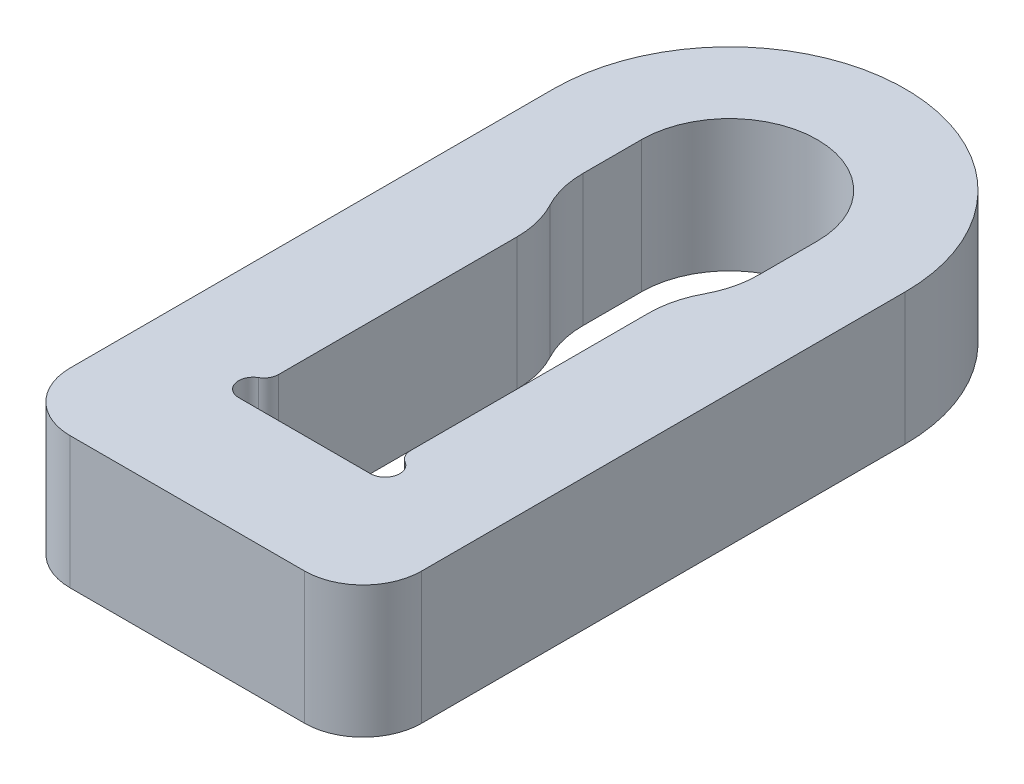
ISO-10303-21;
HEADER;
FILE_DESCRIPTION(('STEP AP214'),'2;1');
FILE_NAME('part.step','',(''),(''),'','','');
FILE_SCHEMA(('AUTOMOTIVE_DESIGN { 1 0 10303 214 1 1 1 1 }'));
ENDSEC;
DATA;
#1=APPLICATION_CONTEXT('core data for automotive mechanical design processes');
#2=APPLICATION_PROTOCOL_DEFINITION('international standard','automotive_design',2000,#1);
#3=PRODUCT_CONTEXT('',#1,'mechanical');
#4=PRODUCT('Part','Part','',(#3));
#5=PRODUCT_RELATED_PRODUCT_CATEGORY('part','',(#4));
#6=PRODUCT_DEFINITION_FORMATION('','',#4);
#7=PRODUCT_DEFINITION_CONTEXT('part definition',#1,'design');
#8=PRODUCT_DEFINITION('design','',#6,#7);
#9=PRODUCT_DEFINITION_SHAPE('','',#8);
#10=(LENGTH_UNIT() NAMED_UNIT(*) SI_UNIT(.MILLI.,.METRE.));
#11=(NAMED_UNIT(*) PLANE_ANGLE_UNIT() SI_UNIT($,.RADIAN.));
#12=(NAMED_UNIT(*) SI_UNIT($,.STERADIAN.) SOLID_ANGLE_UNIT());
#13=UNCERTAINTY_MEASURE_WITH_UNIT(LENGTH_MEASURE(1.E-05),#10,'distance_accuracy_value','');
#14=(GEOMETRIC_REPRESENTATION_CONTEXT(3) GLOBAL_UNCERTAINTY_ASSIGNED_CONTEXT((#13)) GLOBAL_UNIT_ASSIGNED_CONTEXT((#10,
#11,#12)) REPRESENTATION_CONTEXT('',''));
#15=CARTESIAN_POINT('',(0.,0.,0.));
#16=DIRECTION('',(0.,0.,1.));
#17=DIRECTION('',(1.,0.,0.));
#18=AXIS2_PLACEMENT_3D('',#15,#16,#17);
#19=CARTESIAN_POINT('',(0.,4.5,0.));
#20=DIRECTION('',(0.,-1.,0.));
#21=DIRECTION('',(0.,0.,-1.));
#22=AXIS2_PLACEMENT_3D('',#19,#20,#21);
#23=PLANE('',#22);
#24=CARTESIAN_POINT('',(0.,4.5,0.));
#25=DIRECTION('',(0.,1.,0.));
#26=DIRECTION('',(0.,0.,-1.));
#27=AXIS2_PLACEMENT_3D('',#24,#25,#26);
#28=CIRCLE('',#27,6.);
#29=CARTESIAN_POINT('',(6.,4.5,0.));
#30=VERTEX_POINT('',#29);
#31=CARTESIAN_POINT('',(-6.,4.5,0.));
#32=VERTEX_POINT('',#31);
#33=EDGE_CURVE('E277',#30,#32,#28,.T.);
#34=ORIENTED_EDGE('',*,*,#33,.T.);
#35=DIRECTION('',(0.,0.,1.));
#36=VECTOR('',#35,1.);
#37=CARTESIAN_POINT('',(-6.,4.5,0.));
#38=LINE('',#37,#36);
#39=CARTESIAN_POINT('',(-6.,4.5,16.5));
#40=VERTEX_POINT('',#39);
#41=EDGE_CURVE('E280',#32,#40,#38,.T.);
#42=ORIENTED_EDGE('',*,*,#41,.T.);
#43=CARTESIAN_POINT('',(-4.,4.5,16.5));
#44=DIRECTION('',(0.,1.,0.));
#45=DIRECTION('',(0.,0.,-1.));
#46=AXIS2_PLACEMENT_3D('',#43,#44,#45);
#47=CIRCLE('',#46,2.);
#48=CARTESIAN_POINT('',(-4.,4.5,18.5));
#49=VERTEX_POINT('',#48);
#50=EDGE_CURVE('E283',#40,#49,#47,.T.);
#51=ORIENTED_EDGE('',*,*,#50,.T.);
#52=DIRECTION('',(1.,0.,0.));
#53=VECTOR('',#52,1.);
#54=CARTESIAN_POINT('',(-4.,4.5,18.5));
#55=LINE('',#54,#53);
#56=CARTESIAN_POINT('',(4.,4.5,18.5));
#57=VERTEX_POINT('',#56);
#58=EDGE_CURVE('E285',#49,#57,#55,.T.);
#59=ORIENTED_EDGE('',*,*,#58,.T.);
#60=CARTESIAN_POINT('',(4.,4.5,16.5));
#61=DIRECTION('',(0.,1.,0.));
#62=DIRECTION('',(0.,0.,1.));
#63=AXIS2_PLACEMENT_3D('',#60,#61,#62);
#64=CIRCLE('',#63,2.);
#65=CARTESIAN_POINT('',(6.,4.5,16.5));
#66=VERTEX_POINT('',#65);
#67=EDGE_CURVE('E287',#57,#66,#64,.T.);
#68=ORIENTED_EDGE('',*,*,#67,.T.);
#69=DIRECTION('',(0.,0.,-1.));
#70=VECTOR('',#69,1.);
#71=CARTESIAN_POINT('',(6.,4.5,16.5));
#72=LINE('',#71,#70);
#73=EDGE_CURVE('E289',#66,#30,#72,.T.);
#74=ORIENTED_EDGE('',*,*,#73,.T.);
#75=EDGE_LOOP('',(#34,#42,#51,#59,#68,#74));
#76=FACE_BOUND('',#75,.T.);
#77=CARTESIAN_POINT('',(0.,4.5,0.));
#78=DIRECTION('',(0.,1.,0.));
#79=DIRECTION('',(0.,0.,1.));
#80=AXIS2_PLACEMENT_3D('',#77,#78,#79);
#81=CIRCLE('',#80,3.);
#82=CARTESIAN_POINT('',(3.,4.5,0.));
#83=VERTEX_POINT('',#82);
#84=CARTESIAN_POINT('',(-3.,4.5,0.));
#85=VERTEX_POINT('',#84);
#86=EDGE_CURVE('E170',#83,#85,#81,.T.);
#87=ORIENTED_EDGE('',*,*,#86,.F.);
#88=DIRECTION('',(0.,0.,-1.));
#89=VECTOR('',#88,1.);
#90=CARTESIAN_POINT('',(3.,4.5,0.));
#91=LINE('',#90,#89);
#92=CARTESIAN_POINT('',(3.,4.5,2.));
#93=VERTEX_POINT('',#92);
#94=EDGE_CURVE('E215',#93,#83,#91,.T.);
#95=ORIENTED_EDGE('',*,*,#94,.F.);
#96=CARTESIAN_POINT('',(-0.187500000000005,4.5,2.));
#97=DIRECTION('',(0.,1.,0.));
#98=DIRECTION('',(0.,0.,1.));
#99=AXIS2_PLACEMENT_3D('',#96,#97,#98);
#100=CIRCLE('',#99,3.1875);
#101=CARTESIAN_POINT('',(2.625,4.5,3.5));
#102=VERTEX_POINT('',#101);
#103=EDGE_CURVE('E213',#102,#93,#100,.T.);
#104=ORIENTED_EDGE('',*,*,#103,.F.);
#105=CARTESIAN_POINT('',(5.4375,4.5,5.));
#106=DIRECTION('',(0.,-1.,0.));
#107=DIRECTION('',(0.,0.,-1.));
#108=AXIS2_PLACEMENT_3D('',#105,#106,#107);
#109=CIRCLE('',#108,3.1875);
#110=CARTESIAN_POINT('',(2.25,4.5,5.));
#111=VERTEX_POINT('',#110);
#112=EDGE_CURVE('E211',#111,#102,#109,.T.);
#113=ORIENTED_EDGE('',*,*,#112,.F.);
#114=DIRECTION('',(0.,0.,-1.));
#115=VECTOR('',#114,1.);
#116=CARTESIAN_POINT('',(2.25,4.5,5.));
#117=LINE('',#116,#115);
#118=CARTESIAN_POINT('',(2.25,4.5,13.1339745962156));
#119=VERTEX_POINT('',#118);
#120=EDGE_CURVE('E209',#119,#111,#117,.T.);
#121=ORIENTED_EDGE('',*,*,#120,.F.);
#122=CARTESIAN_POINT('',(2.75,4.5,13.1339745962156));
#123=DIRECTION('',(0.,-1.,0.));
#124=DIRECTION('',(0.,0.,-1.));
#125=AXIS2_PLACEMENT_3D('',#122,#123,#124);
#126=CIRCLE('',#125,0.5);
#127=CARTESIAN_POINT('',(2.5,4.5,13.5669872981078));
#128=VERTEX_POINT('',#127);
#129=EDGE_CURVE('E207',#128,#119,#126,.T.);
#130=ORIENTED_EDGE('',*,*,#129,.F.);
#131=CARTESIAN_POINT('',(2.25,4.5,14.));
#132=DIRECTION('',(0.,1.,0.));
#133=DIRECTION('',(0.,0.,1.));
#134=AXIS2_PLACEMENT_3D('',#131,#132,#133);
#135=CIRCLE('',#134,0.5);
#136=CARTESIAN_POINT('',(2.25,4.5,14.5));
#137=VERTEX_POINT('',#136);
#138=EDGE_CURVE('E205',#137,#128,#135,.T.);
#139=ORIENTED_EDGE('',*,*,#138,.F.);
#140=DIRECTION('',(1.,0.,0.));
#141=VECTOR('',#140,1.);
#142=CARTESIAN_POINT('',(-2.25,4.5,14.5));
#143=LINE('',#142,#141);
#144=CARTESIAN_POINT('',(-2.25,4.5,14.5));
#145=VERTEX_POINT('',#144);
#146=EDGE_CURVE('E203',#145,#137,#143,.T.);
#147=ORIENTED_EDGE('',*,*,#146,.F.);
#148=CARTESIAN_POINT('',(-2.25,4.5,14.));
#149=DIRECTION('',(0.,1.,0.));
#150=DIRECTION('',(0.,0.,-1.));
#151=AXIS2_PLACEMENT_3D('',#148,#149,#150);
#152=CIRCLE('',#151,0.5);
#153=CARTESIAN_POINT('',(-2.5,4.5,13.5669872981078));
#154=VERTEX_POINT('',#153);
#155=EDGE_CURVE('E201',#154,#145,#152,.T.);
#156=ORIENTED_EDGE('',*,*,#155,.F.);
#157=CARTESIAN_POINT('',(-2.75,4.5,13.1339745962156));
#158=DIRECTION('',(0.,-1.,0.));
#159=DIRECTION('',(0.,0.,1.));
#160=AXIS2_PLACEMENT_3D('',#157,#158,#159);
#161=CIRCLE('',#160,0.5);
#162=CARTESIAN_POINT('',(-2.25,4.5,13.1339745962156));
#163=VERTEX_POINT('',#162);
#164=EDGE_CURVE('E199',#163,#154,#161,.T.);
#165=ORIENTED_EDGE('',*,*,#164,.F.);
#166=DIRECTION('',(0.,0.,1.));
#167=VECTOR('',#166,1.);
#168=CARTESIAN_POINT('',(-2.25,4.5,5.));
#169=LINE('',#168,#167);
#170=CARTESIAN_POINT('',(-2.25,4.5,5.));
#171=VERTEX_POINT('',#170);
#172=EDGE_CURVE('E197',#171,#163,#169,.T.);
#173=ORIENTED_EDGE('',*,*,#172,.F.);
#174=CARTESIAN_POINT('',(-5.4375,4.5,4.99999999999999));
#175=DIRECTION('',(0.,-1.,0.));
#176=DIRECTION('',(0.,0.,1.));
#177=AXIS2_PLACEMENT_3D('',#174,#175,#176);
#178=CIRCLE('',#177,3.1875);
#179=CARTESIAN_POINT('',(-2.625,4.5,3.49999999999999));
#180=VERTEX_POINT('',#179);
#181=EDGE_CURVE('E193',#180,#171,#178,.T.);
#182=ORIENTED_EDGE('',*,*,#181,.F.);
#183=CARTESIAN_POINT('',(0.187500000000005,4.5,1.99999999999999));
#184=DIRECTION('',(0.,1.,0.));
#185=DIRECTION('',(0.,0.,-1.));
#186=AXIS2_PLACEMENT_3D('',#183,#184,#185);
#187=CIRCLE('',#186,3.1875);
#188=CARTESIAN_POINT('',(-3.,4.5,1.99999999999999));
#189=VERTEX_POINT('',#188);
#190=EDGE_CURVE('E191',#189,#180,#187,.T.);
#191=ORIENTED_EDGE('',*,*,#190,.F.);
#192=DIRECTION('',(0.,0.,1.));
#193=VECTOR('',#192,1.);
#194=CARTESIAN_POINT('',(-3.,4.5,0.));
#195=LINE('',#194,#193);
#196=EDGE_CURVE('E178',#85,#189,#195,.T.);
#197=ORIENTED_EDGE('',*,*,#196,.F.);
#198=EDGE_LOOP('',(#87,#95,#104,#113,#121,#130,#139,#147,#156,#165,#173,#182,#191,#197));
#199=FACE_BOUND('',#198,.T.);
#200=ADVANCED_FACE('F33',(#76,#199),#23,.F.);
#201=CARTESIAN_POINT('',(0.,0.,0.));
#202=DIRECTION('',(0.,-1.,0.));
#203=DIRECTION('',(0.,0.,-1.));
#204=AXIS2_PLACEMENT_3D('',#201,#202,#203);
#205=PLANE('',#204);
#206=CARTESIAN_POINT('',(0.,0.,0.));
#207=DIRECTION('',(0.,1.,0.));
#208=DIRECTION('',(0.,0.,-1.));
#209=AXIS2_PLACEMENT_3D('',#206,#207,#208);
#210=CIRCLE('',#209,6.);
#211=CARTESIAN_POINT('',(6.,0.,0.));
#212=VERTEX_POINT('',#211);
#213=CARTESIAN_POINT('',(-6.,0.,0.));
#214=VERTEX_POINT('',#213);
#215=EDGE_CURVE('E186',#212,#214,#210,.T.);
#216=ORIENTED_EDGE('',*,*,#215,.F.);
#217=DIRECTION('',(0.,0.,-1.));
#218=VECTOR('',#217,1.);
#219=CARTESIAN_POINT('',(6.00000000000001,0.,5.));
#220=LINE('',#219,#218);
#221=CARTESIAN_POINT('',(6.,0.,16.5));
#222=VERTEX_POINT('',#221);
#223=EDGE_CURVE('E281',#222,#212,#220,.T.);
#224=ORIENTED_EDGE('',*,*,#223,.F.);
#225=CARTESIAN_POINT('',(4.,0.,16.5));
#226=DIRECTION('',(0.,1.,0.));
#227=DIRECTION('',(0.,0.,1.));
#228=AXIS2_PLACEMENT_3D('',#225,#226,#227);
#229=CIRCLE('',#228,2.);
#230=CARTESIAN_POINT('',(4.,0.,18.5));
#231=VERTEX_POINT('',#230);
#232=EDGE_CURVE('E300',#231,#222,#229,.T.);
#233=ORIENTED_EDGE('',*,*,#232,.F.);
#234=DIRECTION('',(1.,0.,0.));
#235=VECTOR('',#234,1.);
#236=CARTESIAN_POINT('',(-4.,0.,18.5));
#237=LINE('',#236,#235);
#238=CARTESIAN_POINT('',(-4.,0.,18.5));
#239=VERTEX_POINT('',#238);
#240=EDGE_CURVE('E298',#239,#231,#237,.T.);
#241=ORIENTED_EDGE('',*,*,#240,.F.);
#242=CARTESIAN_POINT('',(-4.,0.,16.5));
#243=DIRECTION('',(0.,1.,0.));
#244=DIRECTION('',(0.,0.,-1.));
#245=AXIS2_PLACEMENT_3D('',#242,#243,#244);
#246=CIRCLE('',#245,2.);
#247=CARTESIAN_POINT('',(-6.,0.,16.5));
#248=VERTEX_POINT('',#247);
#249=EDGE_CURVE('E296',#248,#239,#246,.T.);
#250=ORIENTED_EDGE('',*,*,#249,.F.);
#251=DIRECTION('',(0.,0.,1.));
#252=VECTOR('',#251,1.);
#253=CARTESIAN_POINT('',(-6.,0.,5.));
#254=LINE('',#253,#252);
#255=EDGE_CURVE('E294',#214,#248,#254,.T.);
#256=ORIENTED_EDGE('',*,*,#255,.F.);
#257=EDGE_LOOP('',(#216,#224,#233,#241,#250,#256));
#258=FACE_BOUND('',#257,.T.);
#259=DIRECTION('',(0.,0.,-1.));
#260=VECTOR('',#259,1.);
#261=CARTESIAN_POINT('',(3.,0.,0.));
#262=LINE('',#261,#260);
#263=CARTESIAN_POINT('',(3.,0.,2.));
#264=VERTEX_POINT('',#263);
#265=CARTESIAN_POINT('',(3.,0.,0.));
#266=VERTEX_POINT('',#265);
#267=EDGE_CURVE('E179',#264,#266,#262,.T.);
#268=ORIENTED_EDGE('',*,*,#267,.T.);
#269=CARTESIAN_POINT('',(0.,0.,0.));
#270=DIRECTION('',(0.,1.,0.));
#271=DIRECTION('',(0.,0.,1.));
#272=AXIS2_PLACEMENT_3D('',#269,#270,#271);
#273=CIRCLE('',#272,3.);
#274=CARTESIAN_POINT('',(-3.,0.,0.));
#275=VERTEX_POINT('',#274);
#276=EDGE_CURVE('E56',#266,#275,#273,.T.);
#277=ORIENTED_EDGE('',*,*,#276,.T.);
#278=DIRECTION('',(0.,0.,1.));
#279=VECTOR('',#278,1.);
#280=CARTESIAN_POINT('',(-3.,0.,0.));
#281=LINE('',#280,#279);
#282=CARTESIAN_POINT('',(-3.,0.,1.99999999999999));
#283=VERTEX_POINT('',#282);
#284=EDGE_CURVE('E185',#275,#283,#281,.T.);
#285=ORIENTED_EDGE('',*,*,#284,.T.);
#286=CARTESIAN_POINT('',(0.187500000000005,0.,1.99999999999999));
#287=DIRECTION('',(0.,1.,0.));
#288=DIRECTION('',(0.,0.,-1.));
#289=AXIS2_PLACEMENT_3D('',#286,#287,#288);
#290=CIRCLE('',#289,3.1875);
#291=CARTESIAN_POINT('',(-2.625,0.,3.49999999999999));
#292=VERTEX_POINT('',#291);
#293=EDGE_CURVE('E219',#283,#292,#290,.T.);
#294=ORIENTED_EDGE('',*,*,#293,.T.);
#295=CARTESIAN_POINT('',(-5.4375,0.,4.99999999999999));
#296=DIRECTION('',(0.,-1.,0.));
#297=DIRECTION('',(0.,0.,1.));
#298=AXIS2_PLACEMENT_3D('',#295,#296,#297);
#299=CIRCLE('',#298,3.1875);
#300=CARTESIAN_POINT('',(-2.25,0.,5.));
#301=VERTEX_POINT('',#300);
#302=EDGE_CURVE('E222',#292,#301,#299,.T.);
#303=ORIENTED_EDGE('',*,*,#302,.T.);
#304=DIRECTION('',(0.,0.,1.));
#305=VECTOR('',#304,1.);
#306=CARTESIAN_POINT('',(-2.25,0.,5.));
#307=LINE('',#306,#305);
#308=CARTESIAN_POINT('',(-2.25,0.,13.1339745962156));
#309=VERTEX_POINT('',#308);
#310=EDGE_CURVE('E225',#301,#309,#307,.T.);
#311=ORIENTED_EDGE('',*,*,#310,.T.);
#312=CARTESIAN_POINT('',(-2.75,0.,13.1339745962156));
#313=DIRECTION('',(0.,-1.,0.));
#314=DIRECTION('',(0.,0.,1.));
#315=AXIS2_PLACEMENT_3D('',#312,#313,#314);
#316=CIRCLE('',#315,0.5);
#317=CARTESIAN_POINT('',(-2.5,0.,13.5669872981078));
#318=VERTEX_POINT('',#317);
#319=EDGE_CURVE('E228',#309,#318,#316,.T.);
#320=ORIENTED_EDGE('',*,*,#319,.T.);
#321=CARTESIAN_POINT('',(-2.25,0.,14.));
#322=DIRECTION('',(0.,1.,0.));
#323=DIRECTION('',(0.,0.,-1.));
#324=AXIS2_PLACEMENT_3D('',#321,#322,#323);
#325=CIRCLE('',#324,0.5);
#326=CARTESIAN_POINT('',(-2.25,0.,14.5));
#327=VERTEX_POINT('',#326);
#328=EDGE_CURVE('E231',#318,#327,#325,.T.);
#329=ORIENTED_EDGE('',*,*,#328,.T.);
#330=DIRECTION('',(1.,0.,0.));
#331=VECTOR('',#330,1.);
#332=CARTESIAN_POINT('',(-2.25,0.,14.5));
#333=LINE('',#332,#331);
#334=CARTESIAN_POINT('',(2.25,0.,14.5));
#335=VERTEX_POINT('',#334);
#336=EDGE_CURVE('E234',#327,#335,#333,.T.);
#337=ORIENTED_EDGE('',*,*,#336,.T.);
#338=CARTESIAN_POINT('',(2.25,0.,14.));
#339=DIRECTION('',(0.,1.,0.));
#340=DIRECTION('',(0.,0.,1.));
#341=AXIS2_PLACEMENT_3D('',#338,#339,#340);
#342=CIRCLE('',#341,0.5);
#343=CARTESIAN_POINT('',(2.5,0.,13.5669872981078));
#344=VERTEX_POINT('',#343);
#345=EDGE_CURVE('E237',#335,#344,#342,.T.);
#346=ORIENTED_EDGE('',*,*,#345,.T.);
#347=CARTESIAN_POINT('',(2.75,0.,13.1339745962156));
#348=DIRECTION('',(0.,-1.,0.));
#349=DIRECTION('',(0.,0.,-1.));
#350=AXIS2_PLACEMENT_3D('',#347,#348,#349);
#351=CIRCLE('',#350,0.5);
#352=CARTESIAN_POINT('',(2.25,0.,13.1339745962156));
#353=VERTEX_POINT('',#352);
#354=EDGE_CURVE('E240',#344,#353,#351,.T.);
#355=ORIENTED_EDGE('',*,*,#354,.T.);
#356=DIRECTION('',(0.,0.,-1.));
#357=VECTOR('',#356,1.);
#358=CARTESIAN_POINT('',(2.25,0.,5.));
#359=LINE('',#358,#357);
#360=CARTESIAN_POINT('',(2.25,0.,5.));
#361=VERTEX_POINT('',#360);
#362=EDGE_CURVE('E243',#353,#361,#359,.T.);
#363=ORIENTED_EDGE('',*,*,#362,.T.);
#364=CARTESIAN_POINT('',(5.4375,0.,5.));
#365=DIRECTION('',(0.,-1.,0.));
#366=DIRECTION('',(0.,0.,-1.));
#367=AXIS2_PLACEMENT_3D('',#364,#365,#366);
#368=CIRCLE('',#367,3.1875);
#369=CARTESIAN_POINT('',(2.625,0.,3.5));
#370=VERTEX_POINT('',#369);
#371=EDGE_CURVE('E246',#361,#370,#368,.T.);
#372=ORIENTED_EDGE('',*,*,#371,.T.);
#373=CARTESIAN_POINT('',(-0.187500000000005,0.,2.));
#374=DIRECTION('',(0.,1.,0.));
#375=DIRECTION('',(0.,0.,1.));
#376=AXIS2_PLACEMENT_3D('',#373,#374,#375);
#377=CIRCLE('',#376,3.1875);
#378=EDGE_CURVE('E249',#370,#264,#377,.T.);
#379=ORIENTED_EDGE('',*,*,#378,.T.);
#380=EDGE_LOOP('',(#268,#277,#285,#294,#303,#311,#320,#329,#337,#346,#355,#363,#372,#379));
#381=FACE_BOUND('',#380,.T.);
#382=ADVANCED_FACE('F325',(#258,#381),#205,.T.);
#383=CARTESIAN_POINT('',(0.,4.5,0.));
#384=DIRECTION('',(0.,-1.,0.));
#385=DIRECTION('',(0.,0.,-1.));
#386=AXIS2_PLACEMENT_3D('',#383,#384,#385);
#387=CYLINDRICAL_SURFACE('',#386,6.);
#388=ORIENTED_EDGE('',*,*,#215,.T.);
#389=DIRECTION('',(0.,-1.,0.));
#390=VECTOR('',#389,1.);
#391=CARTESIAN_POINT('',(-6.,4.5,0.));
#392=LINE('',#391,#390);
#393=EDGE_CURVE('E11',#32,#214,#392,.T.);
#394=ORIENTED_EDGE('',*,*,#393,.F.);
#395=ORIENTED_EDGE('',*,*,#33,.F.);
#396=DIRECTION('',(0.,-1.,0.));
#397=VECTOR('',#396,1.);
#398=CARTESIAN_POINT('',(6.,4.5,0.));
#399=LINE('',#398,#397);
#400=EDGE_CURVE('E291',#30,#212,#399,.T.);
#401=ORIENTED_EDGE('',*,*,#400,.T.);
#402=EDGE_LOOP('',(#388,#394,#395,#401));
#403=FACE_BOUND('',#402,.T.);
#404=ADVANCED_FACE('F35',(#403),#387,.T.);
#405=CARTESIAN_POINT('',(-6.,4.5,5.));
#406=DIRECTION('',(1.,0.,0.));
#407=DIRECTION('',(0.,0.,-1.));
#408=AXIS2_PLACEMENT_3D('',#405,#406,#407);
#409=PLANE('',#408);
#410=ORIENTED_EDGE('',*,*,#255,.T.);
#411=DIRECTION('',(0.,-1.,0.));
#412=VECTOR('',#411,1.);
#413=CARTESIAN_POINT('',(-6.,4.5,16.5));
#414=LINE('',#413,#412);
#415=EDGE_CURVE('E41',#40,#248,#414,.T.);
#416=ORIENTED_EDGE('',*,*,#415,.F.);
#417=ORIENTED_EDGE('',*,*,#41,.F.);
#418=ORIENTED_EDGE('',*,*,#393,.T.);
#419=EDGE_LOOP('',(#410,#416,#417,#418));
#420=FACE_BOUND('',#419,.T.);
#421=ADVANCED_FACE('F341',(#420),#409,.F.);
#422=CARTESIAN_POINT('',(-4.,4.5,16.5));
#423=DIRECTION('',(0.,-1.,0.));
#424=DIRECTION('',(0.,0.,-1.));
#425=AXIS2_PLACEMENT_3D('',#422,#423,#424);
#426=CYLINDRICAL_SURFACE('',#425,2.);
#427=ORIENTED_EDGE('',*,*,#249,.T.);
#428=DIRECTION('',(0.,-1.,0.));
#429=VECTOR('',#428,1.);
#430=CARTESIAN_POINT('',(-4.,4.5,18.5));
#431=LINE('',#430,#429);
#432=EDGE_CURVE('E312',#49,#239,#431,.T.);
#433=ORIENTED_EDGE('',*,*,#432,.F.);
#434=ORIENTED_EDGE('',*,*,#50,.F.);
#435=ORIENTED_EDGE('',*,*,#415,.T.);
#436=EDGE_LOOP('',(#427,#433,#434,#435));
#437=FACE_BOUND('',#436,.T.);
#438=ADVANCED_FACE('F319',(#437),#426,.T.);
#439=CARTESIAN_POINT('',(-4.,4.5,18.5));
#440=DIRECTION('',(0.,0.,-1.));
#441=DIRECTION('',(-1.,0.,0.));
#442=AXIS2_PLACEMENT_3D('',#439,#440,#441);
#443=PLANE('',#442);
#444=ORIENTED_EDGE('',*,*,#240,.T.);
#445=DIRECTION('',(0.,-1.,0.));
#446=VECTOR('',#445,1.);
#447=CARTESIAN_POINT('',(4.,4.5,18.5));
#448=LINE('',#447,#446);
#449=EDGE_CURVE('E309',#57,#231,#448,.T.);
#450=ORIENTED_EDGE('',*,*,#449,.F.);
#451=ORIENTED_EDGE('',*,*,#58,.F.);
#452=ORIENTED_EDGE('',*,*,#432,.T.);
#453=EDGE_LOOP('',(#444,#450,#451,#452));
#454=FACE_BOUND('',#453,.T.);
#455=ADVANCED_FACE('F330',(#454),#443,.F.);
#456=CARTESIAN_POINT('',(4.,4.5,16.5));
#457=DIRECTION('',(0.,-1.,0.));
#458=DIRECTION('',(0.,0.,-1.));
#459=AXIS2_PLACEMENT_3D('',#456,#457,#458);
#460=CYLINDRICAL_SURFACE('',#459,2.);
#461=ORIENTED_EDGE('',*,*,#232,.T.);
#462=DIRECTION('',(0.,-1.,0.));
#463=VECTOR('',#462,1.);
#464=CARTESIAN_POINT('',(6.,4.5,16.5));
#465=LINE('',#464,#463);
#466=EDGE_CURVE('E306',#66,#222,#465,.T.);
#467=ORIENTED_EDGE('',*,*,#466,.F.);
#468=ORIENTED_EDGE('',*,*,#67,.F.);
#469=ORIENTED_EDGE('',*,*,#449,.T.);
#470=EDGE_LOOP('',(#461,#467,#468,#469));
#471=FACE_BOUND('',#470,.T.);
#472=ADVANCED_FACE('F334',(#471),#460,.T.);
#473=CARTESIAN_POINT('',(6.00000000000001,4.5,5.));
#474=DIRECTION('',(-1.,0.,0.));
#475=DIRECTION('',(0.,0.,1.));
#476=AXIS2_PLACEMENT_3D('',#473,#474,#475);
#477=PLANE('',#476);
#478=ORIENTED_EDGE('',*,*,#223,.T.);
#479=ORIENTED_EDGE('',*,*,#400,.F.);
#480=ORIENTED_EDGE('',*,*,#73,.F.);
#481=ORIENTED_EDGE('',*,*,#466,.T.);
#482=EDGE_LOOP('',(#478,#479,#480,#481));
#483=FACE_BOUND('',#482,.T.);
#484=ADVANCED_FACE('F344',(#483),#477,.F.);
#485=CARTESIAN_POINT('',(0.,4.5,0.));
#486=DIRECTION('',(0.,-1.,0.));
#487=DIRECTION('',(0.,0.,-1.));
#488=AXIS2_PLACEMENT_3D('',#485,#486,#487);
#489=CYLINDRICAL_SURFACE('',#488,3.);
#490=ORIENTED_EDGE('',*,*,#276,.F.);
#491=DIRECTION('',(0.,-1.,0.));
#492=VECTOR('',#491,1.);
#493=CARTESIAN_POINT('',(3.,4.5,0.));
#494=LINE('',#493,#492);
#495=EDGE_CURVE('E174',#83,#266,#494,.T.);
#496=ORIENTED_EDGE('',*,*,#495,.F.);
#497=ORIENTED_EDGE('',*,*,#86,.T.);
#498=DIRECTION('',(0.,-1.,0.));
#499=VECTOR('',#498,1.);
#500=CARTESIAN_POINT('',(-3.,4.5,0.));
#501=LINE('',#500,#499);
#502=EDGE_CURVE('E173',#85,#275,#501,.T.);
#503=ORIENTED_EDGE('',*,*,#502,.T.);
#504=EDGE_LOOP('',(#490,#496,#497,#503));
#505=FACE_BOUND('',#504,.T.);
#506=ADVANCED_FACE('F172',(#505),#489,.F.);
#507=CARTESIAN_POINT('',(-3.,4.5,0.));
#508=DIRECTION('',(1.,0.,0.));
#509=DIRECTION('',(0.,0.,-1.));
#510=AXIS2_PLACEMENT_3D('',#507,#508,#509);
#511=PLANE('',#510);
#512=ORIENTED_EDGE('',*,*,#284,.F.);
#513=ORIENTED_EDGE('',*,*,#502,.F.);
#514=ORIENTED_EDGE('',*,*,#196,.T.);
#515=DIRECTION('',(0.,-1.,0.));
#516=VECTOR('',#515,1.);
#517=CARTESIAN_POINT('',(-3.,4.5,1.99999999999999));
#518=LINE('',#517,#516);
#519=EDGE_CURVE('E187',#189,#283,#518,.T.);
#520=ORIENTED_EDGE('',*,*,#519,.T.);
#521=EDGE_LOOP('',(#512,#513,#514,#520));
#522=FACE_BOUND('',#521,.T.);
#523=ADVANCED_FACE('F182',(#522),#511,.T.);
#524=CARTESIAN_POINT('',(0.187500000000005,4.5,1.99999999999999));
#525=DIRECTION('',(0.,-1.,0.));
#526=DIRECTION('',(0.,0.,-1.));
#527=AXIS2_PLACEMENT_3D('',#524,#525,#526);
#528=CYLINDRICAL_SURFACE('',#527,3.1875);
#529=ORIENTED_EDGE('',*,*,#293,.F.);
#530=ORIENTED_EDGE('',*,*,#519,.F.);
#531=ORIENTED_EDGE('',*,*,#190,.T.);
#532=DIRECTION('',(0.,-1.,0.));
#533=VECTOR('',#532,1.);
#534=CARTESIAN_POINT('',(-2.625,4.5,3.49999999999999));
#535=LINE('',#534,#533);
#536=EDGE_CURVE('E274',#180,#292,#535,.T.);
#537=ORIENTED_EDGE('',*,*,#536,.T.);
#538=EDGE_LOOP('',(#529,#530,#531,#537));
#539=FACE_BOUND('',#538,.T.);
#540=ADVANCED_FACE('F362',(#539),#528,.F.);
#541=CARTESIAN_POINT('',(-5.4375,4.5,4.99999999999999));
#542=DIRECTION('',(0.,-1.,0.));
#543=DIRECTION('',(0.,0.,-1.));
#544=AXIS2_PLACEMENT_3D('',#541,#542,#543);
#545=CYLINDRICAL_SURFACE('',#544,3.1875);
#546=ORIENTED_EDGE('',*,*,#302,.F.);
#547=ORIENTED_EDGE('',*,*,#536,.F.);
#548=ORIENTED_EDGE('',*,*,#181,.T.);
#549=DIRECTION('',(0.,-1.,0.));
#550=VECTOR('',#549,1.);
#551=CARTESIAN_POINT('',(-2.25,4.5,5.));
#552=LINE('',#551,#550);
#553=EDGE_CURVE('E272',#171,#301,#552,.T.);
#554=ORIENTED_EDGE('',*,*,#553,.T.);
#555=EDGE_LOOP('',(#546,#547,#548,#554));
#556=FACE_BOUND('',#555,.T.);
#557=ADVANCED_FACE('F365',(#556),#545,.T.);
#558=CARTESIAN_POINT('',(-2.25,4.5,5.));
#559=DIRECTION('',(1.,0.,0.));
#560=DIRECTION('',(0.,0.,-1.));
#561=AXIS2_PLACEMENT_3D('',#558,#559,#560);
#562=PLANE('',#561);
#563=ORIENTED_EDGE('',*,*,#310,.F.);
#564=ORIENTED_EDGE('',*,*,#553,.F.);
#565=ORIENTED_EDGE('',*,*,#172,.T.);
#566=DIRECTION('',(0.,-1.,0.));
#567=VECTOR('',#566,1.);
#568=CARTESIAN_POINT('',(-2.25,4.5,13.1339745962156));
#569=LINE('',#568,#567);
#570=EDGE_CURVE('E270',#163,#309,#569,.T.);
#571=ORIENTED_EDGE('',*,*,#570,.T.);
#572=EDGE_LOOP('',(#563,#564,#565,#571));
#573=FACE_BOUND('',#572,.T.);
#574=ADVANCED_FACE('F369',(#573),#562,.T.);
#575=CARTESIAN_POINT('',(-2.75,4.5,13.1339745962156));
#576=DIRECTION('',(0.,-1.,0.));
#577=DIRECTION('',(0.,0.,-1.));
#578=AXIS2_PLACEMENT_3D('',#575,#576,#577);
#579=CYLINDRICAL_SURFACE('',#578,0.5);
#580=ORIENTED_EDGE('',*,*,#319,.F.);
#581=ORIENTED_EDGE('',*,*,#570,.F.);
#582=ORIENTED_EDGE('',*,*,#164,.T.);
#583=DIRECTION('',(0.,-1.,0.));
#584=VECTOR('',#583,1.);
#585=CARTESIAN_POINT('',(-2.5,4.5,13.5669872981078));
#586=LINE('',#585,#584);
#587=EDGE_CURVE('E268',#154,#318,#586,.T.);
#588=ORIENTED_EDGE('',*,*,#587,.T.);
#589=EDGE_LOOP('',(#580,#581,#582,#588));
#590=FACE_BOUND('',#589,.T.);
#591=ADVANCED_FACE('F373',(#590),#579,.T.);
#592=CARTESIAN_POINT('',(-2.25,4.5,14.));
#593=DIRECTION('',(0.,-1.,0.));
#594=DIRECTION('',(0.,0.,-1.));
#595=AXIS2_PLACEMENT_3D('',#592,#593,#594);
#596=CYLINDRICAL_SURFACE('',#595,0.5);
#597=ORIENTED_EDGE('',*,*,#328,.F.);
#598=ORIENTED_EDGE('',*,*,#587,.F.);
#599=ORIENTED_EDGE('',*,*,#155,.T.);
#600=DIRECTION('',(0.,-1.,0.));
#601=VECTOR('',#600,1.);
#602=CARTESIAN_POINT('',(-2.25,4.5,14.5));
#603=LINE('',#602,#601);
#604=EDGE_CURVE('E266',#145,#327,#603,.T.);
#605=ORIENTED_EDGE('',*,*,#604,.T.);
#606=EDGE_LOOP('',(#597,#598,#599,#605));
#607=FACE_BOUND('',#606,.T.);
#608=ADVANCED_FACE('F377',(#607),#596,.F.);
#609=CARTESIAN_POINT('',(-2.25,4.5,14.5));
#610=DIRECTION('',(0.,0.,-1.));
#611=DIRECTION('',(-1.,0.,0.));
#612=AXIS2_PLACEMENT_3D('',#609,#610,#611);
#613=PLANE('',#612);
#614=ORIENTED_EDGE('',*,*,#336,.F.);
#615=ORIENTED_EDGE('',*,*,#604,.F.);
#616=ORIENTED_EDGE('',*,*,#146,.T.);
#617=DIRECTION('',(0.,-1.,0.));
#618=VECTOR('',#617,1.);
#619=CARTESIAN_POINT('',(2.25,4.5,14.5));
#620=LINE('',#619,#618);
#621=EDGE_CURVE('E264',#137,#335,#620,.T.);
#622=ORIENTED_EDGE('',*,*,#621,.T.);
#623=EDGE_LOOP('',(#614,#615,#616,#622));
#624=FACE_BOUND('',#623,.T.);
#625=ADVANCED_FACE('F381',(#624),#613,.T.);
#626=CARTESIAN_POINT('',(2.25,4.5,14.));
#627=DIRECTION('',(0.,-1.,0.));
#628=DIRECTION('',(0.,0.,-1.));
#629=AXIS2_PLACEMENT_3D('',#626,#627,#628);
#630=CYLINDRICAL_SURFACE('',#629,0.5);
#631=ORIENTED_EDGE('',*,*,#345,.F.);
#632=ORIENTED_EDGE('',*,*,#621,.F.);
#633=ORIENTED_EDGE('',*,*,#138,.T.);
#634=DIRECTION('',(0.,-1.,0.));
#635=VECTOR('',#634,1.);
#636=CARTESIAN_POINT('',(2.5,4.5,13.5669872981078));
#637=LINE('',#636,#635);
#638=EDGE_CURVE('E262',#128,#344,#637,.T.);
#639=ORIENTED_EDGE('',*,*,#638,.T.);
#640=EDGE_LOOP('',(#631,#632,#633,#639));
#641=FACE_BOUND('',#640,.T.);
#642=ADVANCED_FACE('F385',(#641),#630,.F.);
#643=CARTESIAN_POINT('',(2.75,4.5,13.1339745962156));
#644=DIRECTION('',(0.,-1.,0.));
#645=DIRECTION('',(0.,0.,-1.));
#646=AXIS2_PLACEMENT_3D('',#643,#644,#645);
#647=CYLINDRICAL_SURFACE('',#646,0.5);
#648=ORIENTED_EDGE('',*,*,#354,.F.);
#649=ORIENTED_EDGE('',*,*,#638,.F.);
#650=ORIENTED_EDGE('',*,*,#129,.T.);
#651=DIRECTION('',(0.,-1.,0.));
#652=VECTOR('',#651,1.);
#653=CARTESIAN_POINT('',(2.25,4.5,13.1339745962156));
#654=LINE('',#653,#652);
#655=EDGE_CURVE('E260',#119,#353,#654,.T.);
#656=ORIENTED_EDGE('',*,*,#655,.T.);
#657=EDGE_LOOP('',(#648,#649,#650,#656));
#658=FACE_BOUND('',#657,.T.);
#659=ADVANCED_FACE('F389',(#658),#647,.T.);
#660=CARTESIAN_POINT('',(2.25,4.5,5.));
#661=DIRECTION('',(-1.,0.,0.));
#662=DIRECTION('',(0.,0.,1.));
#663=AXIS2_PLACEMENT_3D('',#660,#661,#662);
#664=PLANE('',#663);
#665=ORIENTED_EDGE('',*,*,#362,.F.);
#666=ORIENTED_EDGE('',*,*,#655,.F.);
#667=ORIENTED_EDGE('',*,*,#120,.T.);
#668=DIRECTION('',(0.,-1.,0.));
#669=VECTOR('',#668,1.);
#670=CARTESIAN_POINT('',(2.25,4.5,5.));
#671=LINE('',#670,#669);
#672=EDGE_CURVE('E258',#111,#361,#671,.T.);
#673=ORIENTED_EDGE('',*,*,#672,.T.);
#674=EDGE_LOOP('',(#665,#666,#667,#673));
#675=FACE_BOUND('',#674,.T.);
#676=ADVANCED_FACE('F393',(#675),#664,.T.);
#677=CARTESIAN_POINT('',(5.4375,4.5,5.));
#678=DIRECTION('',(0.,-1.,0.));
#679=DIRECTION('',(0.,0.,-1.));
#680=AXIS2_PLACEMENT_3D('',#677,#678,#679);
#681=CYLINDRICAL_SURFACE('',#680,3.1875);
#682=ORIENTED_EDGE('',*,*,#371,.F.);
#683=ORIENTED_EDGE('',*,*,#672,.F.);
#684=ORIENTED_EDGE('',*,*,#112,.T.);
#685=DIRECTION('',(0.,-1.,0.));
#686=VECTOR('',#685,1.);
#687=CARTESIAN_POINT('',(2.625,4.5,3.5));
#688=LINE('',#687,#686);
#689=EDGE_CURVE('E256',#102,#370,#688,.T.);
#690=ORIENTED_EDGE('',*,*,#689,.T.);
#691=EDGE_LOOP('',(#682,#683,#684,#690));
#692=FACE_BOUND('',#691,.T.);
#693=ADVANCED_FACE('F397',(#692),#681,.T.);
#694=CARTESIAN_POINT('',(-0.187500000000005,4.5,2.));
#695=DIRECTION('',(0.,-1.,0.));
#696=DIRECTION('',(0.,0.,-1.));
#697=AXIS2_PLACEMENT_3D('',#694,#695,#696);
#698=CYLINDRICAL_SURFACE('',#697,3.1875);
#699=ORIENTED_EDGE('',*,*,#378,.F.);
#700=ORIENTED_EDGE('',*,*,#689,.F.);
#701=ORIENTED_EDGE('',*,*,#103,.T.);
#702=DIRECTION('',(0.,-1.,0.));
#703=VECTOR('',#702,1.);
#704=CARTESIAN_POINT('',(3.,4.5,2.));
#705=LINE('',#704,#703);
#706=EDGE_CURVE('E48',#93,#264,#705,.T.);
#707=ORIENTED_EDGE('',*,*,#706,.T.);
#708=EDGE_LOOP('',(#699,#700,#701,#707));
#709=FACE_BOUND('',#708,.T.);
#710=ADVANCED_FACE('F401',(#709),#698,.F.);
#711=CARTESIAN_POINT('',(3.,4.5,0.));
#712=DIRECTION('',(-1.,0.,0.));
#713=DIRECTION('',(0.,0.,1.));
#714=AXIS2_PLACEMENT_3D('',#711,#712,#713);
#715=PLANE('',#714);
#716=ORIENTED_EDGE('',*,*,#267,.F.);
#717=ORIENTED_EDGE('',*,*,#706,.F.);
#718=ORIENTED_EDGE('',*,*,#94,.T.);
#719=ORIENTED_EDGE('',*,*,#495,.T.);
#720=EDGE_LOOP('',(#716,#717,#718,#719));
#721=FACE_BOUND('',#720,.T.);
#722=ADVANCED_FACE('F405',(#721),#715,.T.);
#723=CLOSED_SHELL('',(#200,#382,#404,#421,#438,#455,#472,#484,#506,#523,#540,#557,#574,#591,
#608,#625,#642,#659,#676,#693,#710,#722));
#724=MANIFOLD_SOLID_BREP('B2',#723);
#725=ADVANCED_BREP_SHAPE_REPRESENTATION('',(#18,#724),#14);
#726=SHAPE_DEFINITION_REPRESENTATION(#9,#725);
ENDSEC;
END-ISO-10303-21;
